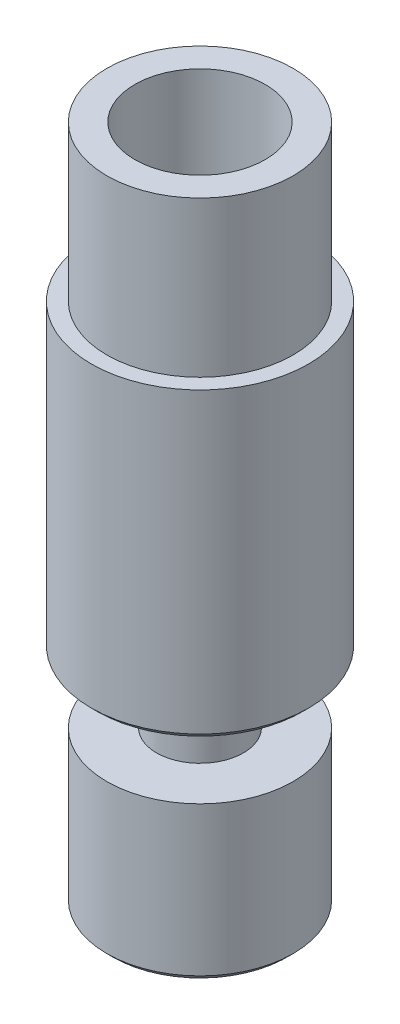
ISO-10303-21;
HEADER;
FILE_DESCRIPTION(('STEP AP214'),'2;1');
FILE_NAME('part.step','',(''),(''),'','','');
FILE_SCHEMA(('AUTOMOTIVE_DESIGN { 1 0 10303 214 1 1 1 1 }'));
ENDSEC;
DATA;
#1=APPLICATION_CONTEXT('core data for automotive mechanical design processes');
#2=APPLICATION_PROTOCOL_DEFINITION('international standard','automotive_design',2000,#1);
#3=PRODUCT_CONTEXT('',#1,'mechanical');
#4=PRODUCT('Part','Part','',(#3));
#5=PRODUCT_RELATED_PRODUCT_CATEGORY('part','',(#4));
#6=PRODUCT_DEFINITION_FORMATION('','',#4);
#7=PRODUCT_DEFINITION_CONTEXT('part definition',#1,'design');
#8=PRODUCT_DEFINITION('design','',#6,#7);
#9=PRODUCT_DEFINITION_SHAPE('','',#8);
#10=(LENGTH_UNIT() NAMED_UNIT(*) SI_UNIT(.MILLI.,.METRE.));
#11=(NAMED_UNIT(*) PLANE_ANGLE_UNIT() SI_UNIT($,.RADIAN.));
#12=(NAMED_UNIT(*) SI_UNIT($,.STERADIAN.) SOLID_ANGLE_UNIT());
#13=UNCERTAINTY_MEASURE_WITH_UNIT(LENGTH_MEASURE(1.E-05),#10,'distance_accuracy_value','');
#14=(GEOMETRIC_REPRESENTATION_CONTEXT(3) GLOBAL_UNCERTAINTY_ASSIGNED_CONTEXT((#13)) GLOBAL_UNIT_ASSIGNED_CONTEXT((#10,
#11,#12)) REPRESENTATION_CONTEXT('',''));
#15=CARTESIAN_POINT('',(0.,0.,0.));
#16=DIRECTION('',(0.,0.,1.));
#17=DIRECTION('',(1.,0.,0.));
#18=AXIS2_PLACEMENT_3D('',#15,#16,#17);
#19=CARTESIAN_POINT('',(3.,-10.95,0.));
#20=DIRECTION('',(0.,1.,0.));
#21=DIRECTION('',(0.,0.,1.));
#22=AXIS2_PLACEMENT_3D('',#19,#20,#21);
#23=PLANE('',#22);
#24=CARTESIAN_POINT('',(0.,-10.95,0.));
#25=DIRECTION('',(0.,1.,0.));
#26=DIRECTION('',(0.,0.,1.));
#27=AXIS2_PLACEMENT_3D('',#24,#25,#26);
#28=CIRCLE('',#27,1.2);
#29=CARTESIAN_POINT('',(0.,-10.95,1.2));
#30=VERTEX_POINT('',#29);
#31=EDGE_CURVE('E52',#30,#30,#28,.T.);
#32=ORIENTED_EDGE('',*,*,#31,.T.);
#33=EDGE_LOOP('',(#32));
#34=FACE_BOUND('',#33,.T.);
#35=CARTESIAN_POINT('',(0.,-10.95,0.));
#36=DIRECTION('',(0.,1.,0.));
#37=DIRECTION('',(0.,0.,1.));
#38=AXIS2_PLACEMENT_3D('',#35,#36,#37);
#39=CIRCLE('',#38,2.8);
#40=CARTESIAN_POINT('',(0.,-10.95,2.8));
#41=VERTEX_POINT('',#40);
#42=EDGE_CURVE('E55',#41,#41,#39,.F.);
#43=ORIENTED_EDGE('',*,*,#42,.T.);
#44=EDGE_LOOP('',(#43));
#45=FACE_BOUND('',#44,.T.);
#46=ADVANCED_FACE('F32',(#34,#45),#23,.F.);
#47=CARTESIAN_POINT('',(0.,10.95,0.));
#48=DIRECTION('',(0.,1.,0.));
#49=DIRECTION('',(0.,0.,1.));
#50=AXIS2_PLACEMENT_3D('',#47,#48,#49);
#51=CYLINDRICAL_SURFACE('',#50,0.999999999999997);
#52=CARTESIAN_POINT('',(0.,-10.75,0.));
#53=DIRECTION('',(0.,1.,0.));
#54=DIRECTION('',(0.,0.,1.));
#55=AXIS2_PLACEMENT_3D('',#52,#53,#54);
#56=CIRCLE('',#55,0.999999999999997);
#57=CARTESIAN_POINT('',(0.,-10.75,0.999999999999997));
#58=VERTEX_POINT('',#57);
#59=EDGE_CURVE('E47',#58,#58,#56,.F.);
#60=ORIENTED_EDGE('',*,*,#59,.T.);
#61=EDGE_LOOP('',(#60));
#62=FACE_BOUND('',#61,.T.);
#63=CARTESIAN_POINT('',(0.,5.31491470389142,0.));
#64=DIRECTION('',(0.,1.,0.));
#65=DIRECTION('',(0.,0.,1.));
#66=AXIS2_PLACEMENT_3D('',#63,#64,#65);
#67=CIRCLE('',#66,0.999999999999997);
#68=CARTESIAN_POINT('',(0.,5.31491470389142,0.999999999999997));
#69=VERTEX_POINT('',#68);
#70=EDGE_CURVE('E58',#69,#69,#67,.T.);
#71=ORIENTED_EDGE('',*,*,#70,.T.);
#72=EDGE_LOOP('',(#71));
#73=FACE_BOUND('',#72,.T.);
#74=ADVANCED_FACE('F104',(#62,#73),#51,.F.);
#75=CARTESIAN_POINT('',(0.,5.95,0.));
#76=DIRECTION('',(0.,1.,0.));
#77=DIRECTION('',(0.,0.,1.));
#78=AXIS2_PLACEMENT_3D('',#75,#76,#77);
#79=CONICAL_SURFACE('',#78,2.1,1.0471975511966);
#80=ORIENTED_EDGE('',*,*,#70,.F.);
#81=EDGE_LOOP('',(#80));
#82=FACE_BOUND('',#81,.T.);
#83=CARTESIAN_POINT('',(0.,5.95,0.));
#84=DIRECTION('',(0.,1.,0.));
#85=DIRECTION('',(0.,0.,1.));
#86=AXIS2_PLACEMENT_3D('',#83,#84,#85);
#87=CIRCLE('',#86,2.1);
#88=CARTESIAN_POINT('',(0.,5.95,2.1));
#89=VERTEX_POINT('',#88);
#90=EDGE_CURVE('E61',#89,#89,#87,.T.);
#91=ORIENTED_EDGE('',*,*,#90,.T.);
#92=EDGE_LOOP('',(#91));
#93=FACE_BOUND('',#92,.T.);
#94=ADVANCED_FACE('F110',(#82,#93),#79,.F.);
#95=CARTESIAN_POINT('',(0.,10.95,0.));
#96=DIRECTION('',(0.,1.,0.));
#97=DIRECTION('',(0.,0.,1.));
#98=AXIS2_PLACEMENT_3D('',#95,#96,#97);
#99=CYLINDRICAL_SURFACE('',#98,2.1);
#100=ORIENTED_EDGE('',*,*,#90,.F.);
#101=EDGE_LOOP('',(#100));
#102=FACE_BOUND('',#101,.T.);
#103=CARTESIAN_POINT('',(0.,10.95,0.));
#104=DIRECTION('',(0.,1.,0.));
#105=DIRECTION('',(0.,0.,1.));
#106=AXIS2_PLACEMENT_3D('',#103,#104,#105);
#107=CIRCLE('',#106,2.1);
#108=CARTESIAN_POINT('',(0.,10.95,2.1));
#109=VERTEX_POINT('',#108);
#110=EDGE_CURVE('E64',#109,#109,#107,.T.);
#111=ORIENTED_EDGE('',*,*,#110,.T.);
#112=EDGE_LOOP('',(#111));
#113=FACE_BOUND('',#112,.T.);
#114=ADVANCED_FACE('F218',(#102,#113),#99,.F.);
#115=CARTESIAN_POINT('',(2.1,10.95,0.));
#116=DIRECTION('',(0.,-1.,0.));
#117=DIRECTION('',(0.,0.,-1.));
#118=AXIS2_PLACEMENT_3D('',#115,#116,#117);
#119=PLANE('',#118);
#120=ORIENTED_EDGE('',*,*,#110,.F.);
#121=EDGE_LOOP('',(#120));
#122=FACE_BOUND('',#121,.T.);
#123=CARTESIAN_POINT('',(0.,10.95,0.));
#124=DIRECTION('',(0.,1.,0.));
#125=DIRECTION('',(0.,0.,1.));
#126=AXIS2_PLACEMENT_3D('',#123,#124,#125);
#127=CIRCLE('',#126,2.99999999999999);
#128=CARTESIAN_POINT('',(0.,10.95,2.99999999999999));
#129=VERTEX_POINT('',#128);
#130=EDGE_CURVE('E67',#129,#129,#127,.T.);
#131=ORIENTED_EDGE('',*,*,#130,.T.);
#132=EDGE_LOOP('',(#131));
#133=FACE_BOUND('',#132,.T.);
#134=ADVANCED_FACE('F208',(#122,#133),#119,.F.);
#135=CARTESIAN_POINT('',(0.,10.95,0.));
#136=DIRECTION('',(0.,1.,0.));
#137=DIRECTION('',(0.,0.,1.));
#138=AXIS2_PLACEMENT_3D('',#135,#136,#137);
#139=CYLINDRICAL_SURFACE('',#138,2.99999999999999);
#140=ORIENTED_EDGE('',*,*,#130,.F.);
#141=EDGE_LOOP('',(#140));
#142=FACE_BOUND('',#141,.T.);
#143=CARTESIAN_POINT('',(0.,5.95,0.));
#144=DIRECTION('',(0.,1.,0.));
#145=DIRECTION('',(0.,0.,1.));
#146=AXIS2_PLACEMENT_3D('',#143,#144,#145);
#147=CIRCLE('',#146,2.99999999999999);
#148=CARTESIAN_POINT('',(0.,5.95,2.99999999999999));
#149=VERTEX_POINT('',#148);
#150=EDGE_CURVE('E70',#149,#149,#147,.T.);
#151=ORIENTED_EDGE('',*,*,#150,.T.);
#152=EDGE_LOOP('',(#151));
#153=FACE_BOUND('',#152,.T.);
#154=ADVANCED_FACE('F198',(#142,#153),#139,.T.);
#155=CARTESIAN_POINT('',(3.,5.95,0.));
#156=DIRECTION('',(0.,-1.,0.));
#157=DIRECTION('',(0.,0.,-1.));
#158=AXIS2_PLACEMENT_3D('',#155,#156,#157);
#159=PLANE('',#158);
#160=ORIENTED_EDGE('',*,*,#150,.F.);
#161=EDGE_LOOP('',(#160));
#162=FACE_BOUND('',#161,.T.);
#163=CARTESIAN_POINT('',(0.,5.95,0.));
#164=DIRECTION('',(0.,1.,0.));
#165=DIRECTION('',(0.,0.,1.));
#166=AXIS2_PLACEMENT_3D('',#163,#164,#165);
#167=CIRCLE('',#166,3.5);
#168=CARTESIAN_POINT('',(0.,5.95,3.5));
#169=VERTEX_POINT('',#168);
#170=EDGE_CURVE('E73',#169,#169,#167,.T.);
#171=ORIENTED_EDGE('',*,*,#170,.T.);
#172=EDGE_LOOP('',(#171));
#173=FACE_BOUND('',#172,.T.);
#174=ADVANCED_FACE('F166',(#162,#173),#159,.F.);
#175=CARTESIAN_POINT('',(0.,10.95,0.));
#176=DIRECTION('',(0.,1.,0.));
#177=DIRECTION('',(0.,0.,1.));
#178=AXIS2_PLACEMENT_3D('',#175,#176,#177);
#179=CYLINDRICAL_SURFACE('',#178,3.5);
#180=CARTESIAN_POINT('',(0.,-3.65000000000001,0.));
#181=DIRECTION('',(0.,1.,0.));
#182=DIRECTION('',(0.,0.,1.));
#183=AXIS2_PLACEMENT_3D('',#180,#181,#182);
#184=CIRCLE('',#183,3.5);
#185=CARTESIAN_POINT('',(0.,-3.65000000000001,3.5));
#186=VERTEX_POINT('',#185);
#187=EDGE_CURVE('E39',#186,#186,#184,.T.);
#188=ORIENTED_EDGE('',*,*,#187,.T.);
#189=EDGE_LOOP('',(#188));
#190=FACE_BOUND('',#189,.T.);
#191=ORIENTED_EDGE('',*,*,#170,.F.);
#192=EDGE_LOOP('',(#191));
#193=FACE_BOUND('',#192,.T.);
#194=ADVANCED_FACE('F155',(#190,#193),#179,.T.);
#195=CARTESIAN_POINT('',(3.5,-3.85,0.));
#196=DIRECTION('',(0.,1.,0.));
#197=DIRECTION('',(0.,0.,1.));
#198=AXIS2_PLACEMENT_3D('',#195,#196,#197);
#199=PLANE('',#198);
#200=CARTESIAN_POINT('',(0.,-3.85,0.));
#201=DIRECTION('',(0.,1.,0.));
#202=DIRECTION('',(0.,0.,1.));
#203=AXIS2_PLACEMENT_3D('',#200,#201,#202);
#204=CIRCLE('',#203,3.3);
#205=CARTESIAN_POINT('',(0.,-3.85,3.3));
#206=VERTEX_POINT('',#205);
#207=EDGE_CURVE('E10',#206,#206,#204,.F.);
#208=ORIENTED_EDGE('',*,*,#207,.T.);
#209=EDGE_LOOP('',(#208));
#210=FACE_BOUND('',#209,.T.);
#211=CARTESIAN_POINT('',(0.,-3.85,0.));
#212=DIRECTION('',(0.,1.,0.));
#213=DIRECTION('',(0.,0.,1.));
#214=AXIS2_PLACEMENT_3D('',#211,#212,#213);
#215=CIRCLE('',#214,1.4);
#216=CARTESIAN_POINT('',(0.,-3.85,1.4));
#217=VERTEX_POINT('',#216);
#218=EDGE_CURVE('E76',#217,#217,#215,.T.);
#219=ORIENTED_EDGE('',*,*,#218,.T.);
#220=EDGE_LOOP('',(#219));
#221=FACE_BOUND('',#220,.T.);
#222=ADVANCED_FACE('F150',(#210,#221),#199,.F.);
#223=CARTESIAN_POINT('',(0.,10.95,0.));
#224=DIRECTION('',(0.,1.,0.));
#225=DIRECTION('',(0.,0.,1.));
#226=AXIS2_PLACEMENT_3D('',#223,#224,#225);
#227=CYLINDRICAL_SURFACE('',#226,1.4);
#228=ORIENTED_EDGE('',*,*,#218,.F.);
#229=EDGE_LOOP('',(#228));
#230=FACE_BOUND('',#229,.T.);
#231=CARTESIAN_POINT('',(0.,-5.95,0.));
#232=DIRECTION('',(0.,1.,0.));
#233=DIRECTION('',(0.,0.,1.));
#234=AXIS2_PLACEMENT_3D('',#231,#232,#233);
#235=CIRCLE('',#234,1.4);
#236=CARTESIAN_POINT('',(0.,-5.95,1.4));
#237=VERTEX_POINT('',#236);
#238=EDGE_CURVE('E79',#237,#237,#235,.T.);
#239=ORIENTED_EDGE('',*,*,#238,.T.);
#240=EDGE_LOOP('',(#239));
#241=FACE_BOUND('',#240,.T.);
#242=ADVANCED_FACE('F100',(#230,#241),#227,.T.);
#243=CARTESIAN_POINT('',(1.4,-5.95,0.));
#244=DIRECTION('',(0.,-1.,0.));
#245=DIRECTION('',(0.,0.,-1.));
#246=AXIS2_PLACEMENT_3D('',#243,#244,#245);
#247=PLANE('',#246);
#248=ORIENTED_EDGE('',*,*,#238,.F.);
#249=EDGE_LOOP('',(#248));
#250=FACE_BOUND('',#249,.T.);
#251=CARTESIAN_POINT('',(0.,-5.95,0.));
#252=DIRECTION('',(0.,1.,0.));
#253=DIRECTION('',(0.,0.,1.));
#254=AXIS2_PLACEMENT_3D('',#251,#252,#253);
#255=CIRCLE('',#254,3.);
#256=CARTESIAN_POINT('',(0.,-5.95,3.));
#257=VERTEX_POINT('',#256);
#258=EDGE_CURVE('E82',#257,#257,#255,.T.);
#259=ORIENTED_EDGE('',*,*,#258,.T.);
#260=EDGE_LOOP('',(#259));
#261=FACE_BOUND('',#260,.T.);
#262=ADVANCED_FACE('F86',(#250,#261),#247,.F.);
#263=CARTESIAN_POINT('',(0.,10.95,0.));
#264=DIRECTION('',(0.,1.,0.));
#265=DIRECTION('',(0.,0.,1.));
#266=AXIS2_PLACEMENT_3D('',#263,#264,#265);
#267=CYLINDRICAL_SURFACE('',#266,3.);
#268=CARTESIAN_POINT('',(0.,-10.75,0.));
#269=DIRECTION('',(0.,1.,0.));
#270=DIRECTION('',(0.,0.,1.));
#271=AXIS2_PLACEMENT_3D('',#268,#269,#270);
#272=CIRCLE('',#271,3.);
#273=CARTESIAN_POINT('',(0.,-10.75,3.));
#274=VERTEX_POINT('',#273);
#275=EDGE_CURVE('E43',#274,#274,#272,.T.);
#276=ORIENTED_EDGE('',*,*,#275,.T.);
#277=EDGE_LOOP('',(#276));
#278=FACE_BOUND('',#277,.T.);
#279=ORIENTED_EDGE('',*,*,#258,.F.);
#280=EDGE_LOOP('',(#279));
#281=FACE_BOUND('',#280,.T.);
#282=ADVANCED_FACE('F88',(#278,#281),#267,.T.);
#283=CARTESIAN_POINT('',(0.,-10.95,0.));
#284=DIRECTION('',(0.,-1.,0.));
#285=DIRECTION('',(0.,0.,-1.));
#286=AXIS2_PLACEMENT_3D('',#283,#284,#285);
#287=CONICAL_SURFACE('',#286,1.2,0.78539816339745);
#288=ORIENTED_EDGE('',*,*,#59,.F.);
#289=EDGE_LOOP('',(#288));
#290=FACE_BOUND('',#289,.T.);
#291=ORIENTED_EDGE('',*,*,#31,.F.);
#292=EDGE_LOOP('',(#291));
#293=FACE_BOUND('',#292,.T.);
#294=ADVANCED_FACE('F90',(#290,#293),#287,.F.);
#295=CARTESIAN_POINT('',(0.,-10.75,0.));
#296=DIRECTION('',(0.,1.,0.));
#297=DIRECTION('',(0.,0.,1.));
#298=AXIS2_PLACEMENT_3D('',#295,#296,#297);
#299=CONICAL_SURFACE('',#298,3.,0.78539816339745);
#300=ORIENTED_EDGE('',*,*,#42,.F.);
#301=EDGE_LOOP('',(#300));
#302=FACE_BOUND('',#301,.T.);
#303=ORIENTED_EDGE('',*,*,#275,.F.);
#304=EDGE_LOOP('',(#303));
#305=FACE_BOUND('',#304,.T.);
#306=ADVANCED_FACE('F97',(#302,#305),#299,.T.);
#307=CARTESIAN_POINT('',(0.,-3.65000000000001,0.));
#308=DIRECTION('',(0.,1.,0.));
#309=DIRECTION('',(0.,0.,1.));
#310=AXIS2_PLACEMENT_3D('',#307,#308,#309);
#311=CONICAL_SURFACE('',#310,3.5,0.785398163397457);
#312=ORIENTED_EDGE('',*,*,#207,.F.);
#313=EDGE_LOOP('',(#312));
#314=FACE_BOUND('',#313,.T.);
#315=ORIENTED_EDGE('',*,*,#187,.F.);
#316=EDGE_LOOP('',(#315));
#317=FACE_BOUND('',#316,.T.);
#318=ADVANCED_FACE('F34',(#314,#317),#311,.T.);
#319=CLOSED_SHELL('',(#46,#74,#94,#114,#134,#154,#174,#194,#222,#242,#262,#282,#294,#306,#318));
#320=MANIFOLD_SOLID_BREP('B2',#319);
#321=ADVANCED_BREP_SHAPE_REPRESENTATION('',(#18,#320),#14);
#322=SHAPE_DEFINITION_REPRESENTATION(#9,#321);
ENDSEC;
END-ISO-10303-21;
